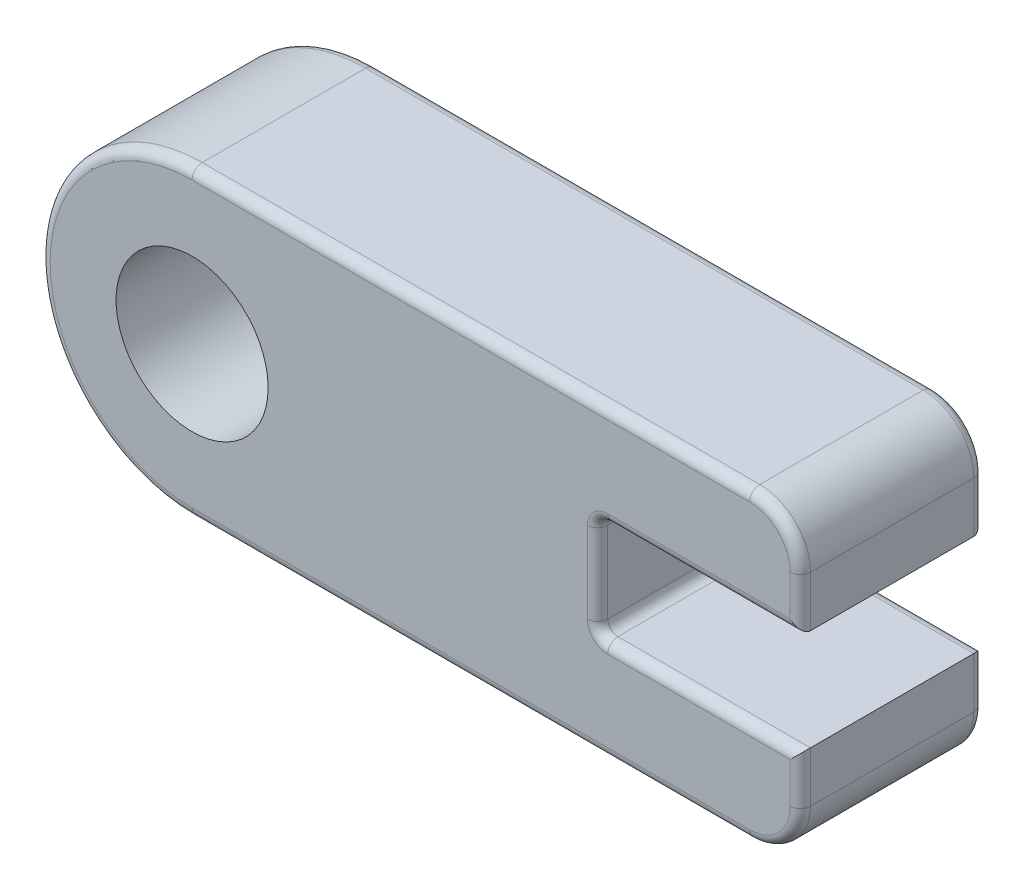
ISO-10303-21;
HEADER;
FILE_DESCRIPTION(('STEP AP214'),'2;1');
FILE_NAME('part.step','',(''),(''),'','','');
FILE_SCHEMA(('AUTOMOTIVE_DESIGN { 1 0 10303 214 1 1 1 1 }'));
ENDSEC;
DATA;
#1=APPLICATION_CONTEXT('core data for automotive mechanical design processes');
#2=APPLICATION_PROTOCOL_DEFINITION('international standard','automotive_design',2000,#1);
#3=PRODUCT_CONTEXT('',#1,'mechanical');
#4=PRODUCT('Part','Part','',(#3));
#5=PRODUCT_RELATED_PRODUCT_CATEGORY('part','',(#4));
#6=PRODUCT_DEFINITION_FORMATION('','',#4);
#7=PRODUCT_DEFINITION_CONTEXT('part definition',#1,'design');
#8=PRODUCT_DEFINITION('design','',#6,#7);
#9=PRODUCT_DEFINITION_SHAPE('','',#8);
#10=(LENGTH_UNIT() NAMED_UNIT(*) SI_UNIT(.MILLI.,.METRE.));
#11=(NAMED_UNIT(*) PLANE_ANGLE_UNIT() SI_UNIT($,.RADIAN.));
#12=(NAMED_UNIT(*) SI_UNIT($,.STERADIAN.) SOLID_ANGLE_UNIT());
#13=UNCERTAINTY_MEASURE_WITH_UNIT(LENGTH_MEASURE(1.E-05),#10,'distance_accuracy_value','');
#14=(GEOMETRIC_REPRESENTATION_CONTEXT(3) GLOBAL_UNCERTAINTY_ASSIGNED_CONTEXT((#13)) GLOBAL_UNIT_ASSIGNED_CONTEXT((#10,
#11,#12)) REPRESENTATION_CONTEXT('',''));
#15=CARTESIAN_POINT('',(0.,0.,0.));
#16=DIRECTION('',(0.,0.,1.));
#17=DIRECTION('',(1.,0.,0.));
#18=AXIS2_PLACEMENT_3D('',#15,#16,#17);
#19=CARTESIAN_POINT('',(-50.8,0.,46.0016430566934));
#20=DIRECTION('',(0.,0.,1.));
#21=DIRECTION('',(1.,0.,0.));
#22=AXIS2_PLACEMENT_3D('',#19,#20,#21);
#23=PLANE('',#22);
#24=CARTESIAN_POINT('',(-50.8,0.,46.0016430566934));
#25=DIRECTION('',(0.,0.,1.));
#26=DIRECTION('',(1.,0.,0.));
#27=AXIS2_PLACEMENT_3D('',#24,#25,#26);
#28=CIRCLE('',#27,35.56);
#29=CARTESIAN_POINT('',(-50.8,35.56,46.0016430566934));
#30=VERTEX_POINT('',#29);
#31=CARTESIAN_POINT('',(-50.8,-35.56,46.0016430566934));
#32=VERTEX_POINT('',#31);
#33=EDGE_CURVE('E359',#30,#32,#28,.T.);
#34=ORIENTED_EDGE('',*,*,#33,.T.);
#35=DIRECTION('',(1.,0.,0.));
#36=VECTOR('',#35,1.);
#37=CARTESIAN_POINT('',(88.9,-35.56,46.0016430566934));
#38=LINE('',#37,#36);
#39=CARTESIAN_POINT('',(88.9,-35.56,46.0016430566934));
#40=VERTEX_POINT('',#39);
#41=EDGE_CURVE('E361',#32,#40,#38,.T.);
#42=ORIENTED_EDGE('',*,*,#41,.T.);
#43=CARTESIAN_POINT('',(88.9,-25.4,46.0016430566934));
#44=DIRECTION('',(0.,0.,1.));
#45=DIRECTION('',(1.,0.,0.));
#46=AXIS2_PLACEMENT_3D('',#43,#44,#45);
#47=CIRCLE('',#46,10.16);
#48=CARTESIAN_POINT('',(99.06,-25.4,46.0016430566934));
#49=VERTEX_POINT('',#48);
#50=EDGE_CURVE('E353',#40,#49,#47,.T.);
#51=ORIENTED_EDGE('',*,*,#50,.T.);
#52=DIRECTION('',(0.,1.,0.));
#53=VECTOR('',#52,1.);
#54=CARTESIAN_POINT('',(99.06,-12.7,46.0016430566934));
#55=LINE('',#54,#53);
#56=CARTESIAN_POINT('',(99.06,-15.24,46.0016430566934));
#57=VERTEX_POINT('',#56);
#58=EDGE_CURVE('E349',#49,#57,#55,.T.);
#59=ORIENTED_EDGE('',*,*,#58,.T.);
#60=DIRECTION('',(-1.,0.,0.));
#61=VECTOR('',#60,1.);
#62=CARTESIAN_POINT('',(50.8,-15.24,46.0016430566934));
#63=LINE('',#62,#61);
#64=CARTESIAN_POINT('',(53.34,-15.24,46.0016430566934));
#65=VERTEX_POINT('',#64);
#66=EDGE_CURVE('E234',#57,#65,#63,.T.);
#67=ORIENTED_EDGE('',*,*,#66,.T.);
#68=CARTESIAN_POINT('',(53.34,-10.16,46.0016430566934));
#69=DIRECTION('',(0.,0.,1.));
#70=DIRECTION('',(1.,0.,0.));
#71=AXIS2_PLACEMENT_3D('',#68,#69,#70);
#72=CIRCLE('',#71,5.08);
#73=CARTESIAN_POINT('',(48.26,-10.16,46.0016430566934));
#74=VERTEX_POINT('',#73);
#75=EDGE_CURVE('E346',#74,#65,#72,.T.);
#76=ORIENTED_EDGE('',*,*,#75,.F.);
#77=DIRECTION('',(0.,1.,0.));
#78=VECTOR('',#77,1.);
#79=CARTESIAN_POINT('',(48.26,12.7,46.0016430566934));
#80=LINE('',#79,#78);
#81=CARTESIAN_POINT('',(48.26,10.16,46.0016430566934));
#82=VERTEX_POINT('',#81);
#83=EDGE_CURVE('E342',#74,#82,#80,.T.);
#84=ORIENTED_EDGE('',*,*,#83,.T.);
#85=CARTESIAN_POINT('',(53.34,10.16,46.0016430566934));
#86=DIRECTION('',(0.,0.,1.));
#87=DIRECTION('',(1.,0.,0.));
#88=AXIS2_PLACEMENT_3D('',#85,#86,#87);
#89=CIRCLE('',#88,5.08);
#90=CARTESIAN_POINT('',(53.34,15.24,46.0016430566934));
#91=VERTEX_POINT('',#90);
#92=EDGE_CURVE('E339',#91,#82,#89,.T.);
#93=ORIENTED_EDGE('',*,*,#92,.F.);
#94=DIRECTION('',(1.,0.,0.));
#95=VECTOR('',#94,1.);
#96=CARTESIAN_POINT('',(101.6,15.24,46.0016430566934));
#97=LINE('',#96,#95);
#98=CARTESIAN_POINT('',(99.06,15.24,46.0016430566934));
#99=VERTEX_POINT('',#98);
#100=EDGE_CURVE('E344',#91,#99,#97,.T.);
#101=ORIENTED_EDGE('',*,*,#100,.T.);
#102=DIRECTION('',(0.,1.,0.));
#103=VECTOR('',#102,1.);
#104=CARTESIAN_POINT('',(99.06,25.4,46.0016430566934));
#105=LINE('',#104,#103);
#106=CARTESIAN_POINT('',(99.06,25.4,46.0016430566934));
#107=VERTEX_POINT('',#106);
#108=EDGE_CURVE('E351',#99,#107,#105,.T.);
#109=ORIENTED_EDGE('',*,*,#108,.T.);
#110=CARTESIAN_POINT('',(88.9,25.4,46.0016430566934));
#111=DIRECTION('',(0.,0.,1.));
#112=DIRECTION('',(1.,0.,0.));
#113=AXIS2_PLACEMENT_3D('',#110,#111,#112);
#114=CIRCLE('',#113,10.16);
#115=CARTESIAN_POINT('',(88.9,35.56,46.0016430566934));
#116=VERTEX_POINT('',#115);
#117=EDGE_CURVE('E355',#107,#116,#114,.T.);
#118=ORIENTED_EDGE('',*,*,#117,.T.);
#119=DIRECTION('',(-1.,0.,0.));
#120=VECTOR('',#119,1.);
#121=CARTESIAN_POINT('',(-50.8,35.56,46.0016430566934));
#122=LINE('',#121,#120);
#123=EDGE_CURVE('E357',#116,#30,#122,.T.);
#124=ORIENTED_EDGE('',*,*,#123,.T.);
#125=EDGE_LOOP('',(#34,#42,#51,#59,#67,#76,#84,#93,#101,#109,#118,#124));
#126=FACE_BOUND('',#125,.T.);
#127=CARTESIAN_POINT('',(-50.8,0.,46.0016430566934));
#128=DIRECTION('',(0.,0.,1.));
#129=DIRECTION('',(1.,0.,0.));
#130=AXIS2_PLACEMENT_3D('',#127,#128,#129);
#131=CIRCLE('',#130,19.05);
#132=CARTESIAN_POINT('',(-31.75,0.,46.0016430566934));
#133=VERTEX_POINT('',#132);
#134=EDGE_CURVE('E279',#133,#133,#131,.T.);
#135=ORIENTED_EDGE('',*,*,#134,.F.);
#136=EDGE_LOOP('',(#135));
#137=FACE_BOUND('',#136,.T.);
#138=ADVANCED_FACE('F35',(#126,#137),#23,.T.);
#139=CARTESIAN_POINT('',(-50.8,0.,0.));
#140=DIRECTION('',(0.,0.,1.));
#141=DIRECTION('',(1.,0.,0.));
#142=AXIS2_PLACEMENT_3D('',#139,#140,#141);
#143=PLANE('',#142);
#144=DIRECTION('',(0.,1.,0.));
#145=VECTOR('',#144,1.);
#146=CARTESIAN_POINT('',(99.06,0.,0.));
#147=LINE('',#146,#145);
#148=CARTESIAN_POINT('',(99.06,-15.24,0.));
#149=VERTEX_POINT('',#148);
#150=CARTESIAN_POINT('',(99.06,-25.4,0.));
#151=VERTEX_POINT('',#150);
#152=EDGE_CURVE('E321',#149,#151,#147,.F.);
#153=ORIENTED_EDGE('',*,*,#152,.T.);
#154=CARTESIAN_POINT('',(88.9,-25.4,0.));
#155=DIRECTION('',(0.,0.,1.));
#156=DIRECTION('',(1.,0.,0.));
#157=AXIS2_PLACEMENT_3D('',#154,#155,#156);
#158=CIRCLE('',#157,10.16);
#159=CARTESIAN_POINT('',(88.9,-35.56,0.));
#160=VERTEX_POINT('',#159);
#161=EDGE_CURVE('E331',#151,#160,#158,.F.);
#162=ORIENTED_EDGE('',*,*,#161,.T.);
#163=DIRECTION('',(1.,0.,0.));
#164=VECTOR('',#163,1.);
#165=CARTESIAN_POINT('',(-50.8,-35.56,0.));
#166=LINE('',#165,#164);
#167=CARTESIAN_POINT('',(-50.8,-35.56,0.));
#168=VERTEX_POINT('',#167);
#169=EDGE_CURVE('E329',#160,#168,#166,.F.);
#170=ORIENTED_EDGE('',*,*,#169,.T.);
#171=CARTESIAN_POINT('',(-50.8,0.,0.));
#172=DIRECTION('',(0.,0.,1.));
#173=DIRECTION('',(1.,0.,0.));
#174=AXIS2_PLACEMENT_3D('',#171,#172,#173);
#175=CIRCLE('',#174,35.56);
#176=CARTESIAN_POINT('',(-50.8,35.56,0.));
#177=VERTEX_POINT('',#176);
#178=EDGE_CURVE('E327',#168,#177,#175,.F.);
#179=ORIENTED_EDGE('',*,*,#178,.T.);
#180=DIRECTION('',(-1.,0.,0.));
#181=VECTOR('',#180,1.);
#182=CARTESIAN_POINT('',(-50.8,35.56,0.));
#183=LINE('',#182,#181);
#184=CARTESIAN_POINT('',(88.9,35.56,0.));
#185=VERTEX_POINT('',#184);
#186=EDGE_CURVE('E325',#177,#185,#183,.F.);
#187=ORIENTED_EDGE('',*,*,#186,.T.);
#188=CARTESIAN_POINT('',(88.9,25.4,0.));
#189=DIRECTION('',(0.,0.,1.));
#190=DIRECTION('',(1.,0.,0.));
#191=AXIS2_PLACEMENT_3D('',#188,#189,#190);
#192=CIRCLE('',#191,10.16);
#193=CARTESIAN_POINT('',(99.06,25.4,0.));
#194=VERTEX_POINT('',#193);
#195=EDGE_CURVE('E323',#185,#194,#192,.F.);
#196=ORIENTED_EDGE('',*,*,#195,.T.);
#197=DIRECTION('',(0.,1.,0.));
#198=VECTOR('',#197,1.);
#199=CARTESIAN_POINT('',(99.06,0.,0.));
#200=LINE('',#199,#198);
#201=CARTESIAN_POINT('',(99.06,15.24,0.));
#202=VERTEX_POINT('',#201);
#203=EDGE_CURVE('E319',#194,#202,#200,.F.);
#204=ORIENTED_EDGE('',*,*,#203,.T.);
#205=DIRECTION('',(1.,0.,0.));
#206=VECTOR('',#205,1.);
#207=CARTESIAN_POINT('',(-50.8,15.24,0.));
#208=LINE('',#207,#206);
#209=CARTESIAN_POINT('',(53.34,15.24,0.));
#210=VERTEX_POINT('',#209);
#211=EDGE_CURVE('E314',#202,#210,#208,.F.);
#212=ORIENTED_EDGE('',*,*,#211,.T.);
#213=CARTESIAN_POINT('',(53.34,10.16,0.));
#214=DIRECTION('',(0.,0.,1.));
#215=DIRECTION('',(1.,0.,0.));
#216=AXIS2_PLACEMENT_3D('',#213,#214,#215);
#217=CIRCLE('',#216,5.08);
#218=CARTESIAN_POINT('',(48.26,10.16,0.));
#219=VERTEX_POINT('',#218);
#220=EDGE_CURVE('E311',#219,#210,#217,.F.);
#221=ORIENTED_EDGE('',*,*,#220,.F.);
#222=DIRECTION('',(0.,1.,0.));
#223=VECTOR('',#222,1.);
#224=CARTESIAN_POINT('',(48.26,0.,0.));
#225=LINE('',#224,#223);
#226=CARTESIAN_POINT('',(48.26,-10.16,0.));
#227=VERTEX_POINT('',#226);
#228=EDGE_CURVE('E309',#219,#227,#225,.F.);
#229=ORIENTED_EDGE('',*,*,#228,.T.);
#230=CARTESIAN_POINT('',(53.34,-10.16,0.));
#231=DIRECTION('',(0.,0.,1.));
#232=DIRECTION('',(1.,0.,0.));
#233=AXIS2_PLACEMENT_3D('',#230,#231,#232);
#234=CIRCLE('',#233,5.08);
#235=CARTESIAN_POINT('',(53.34,-15.24,0.));
#236=VERTEX_POINT('',#235);
#237=EDGE_CURVE('E306',#236,#227,#234,.F.);
#238=ORIENTED_EDGE('',*,*,#237,.F.);
#239=DIRECTION('',(-1.,0.,0.));
#240=VECTOR('',#239,1.);
#241=CARTESIAN_POINT('',(-50.8,-15.24,0.));
#242=LINE('',#241,#240);
#243=EDGE_CURVE('E316',#236,#149,#242,.F.);
#244=ORIENTED_EDGE('',*,*,#243,.T.);
#245=EDGE_LOOP('',(#153,#162,#170,#179,#187,#196,#204,#212,#221,#229,#238,#244));
#246=FACE_BOUND('',#245,.T.);
#247=CARTESIAN_POINT('',(-50.8,0.,0.));
#248=DIRECTION('',(0.,0.,1.));
#249=DIRECTION('',(1.,0.,0.));
#250=AXIS2_PLACEMENT_3D('',#247,#248,#249);
#251=CIRCLE('',#250,19.05);
#252=CARTESIAN_POINT('',(-31.75,0.,0.));
#253=VERTEX_POINT('',#252);
#254=EDGE_CURVE('E273',#253,#253,#251,.T.);
#255=ORIENTED_EDGE('',*,*,#254,.T.);
#256=EDGE_LOOP('',(#255));
#257=FACE_BOUND('',#256,.T.);
#258=ADVANCED_FACE('F468',(#246,#257),#143,.F.);
#259=CARTESIAN_POINT('',(-50.8,0.,46.0016430566934));
#260=DIRECTION('',(0.,0.,-1.));
#261=DIRECTION('',(-1.,0.,0.));
#262=AXIS2_PLACEMENT_3D('',#259,#260,#261);
#263=CYLINDRICAL_SURFACE('',#262,38.1);
#264=DIRECTION('',(0.,0.,-1.));
#265=VECTOR('',#264,1.);
#266=CARTESIAN_POINT('',(-50.8,-38.1,46.0016430566934));
#267=LINE('',#266,#265);
#268=CARTESIAN_POINT('',(-50.8,-38.1,43.4616430566934));
#269=VERTEX_POINT('',#268);
#270=CARTESIAN_POINT('',(-50.8,-38.1,2.54));
#271=VERTEX_POINT('',#270);
#272=EDGE_CURVE('E218',#269,#271,#267,.T.);
#273=ORIENTED_EDGE('',*,*,#272,.F.);
#274=CARTESIAN_POINT('',(-50.8,0.,43.4616430566934));
#275=DIRECTION('',(0.,0.,1.));
#276=DIRECTION('',(1.,0.,0.));
#277=AXIS2_PLACEMENT_3D('',#274,#275,#276);
#278=CIRCLE('',#277,38.1);
#279=CARTESIAN_POINT('',(-50.8,38.1,43.4616430566934));
#280=VERTEX_POINT('',#279);
#281=EDGE_CURVE('E381',#269,#280,#278,.F.);
#282=ORIENTED_EDGE('',*,*,#281,.T.);
#283=DIRECTION('',(0.,0.,-1.));
#284=VECTOR('',#283,1.);
#285=CARTESIAN_POINT('',(-50.8,38.1,46.0016430566934));
#286=LINE('',#285,#284);
#287=CARTESIAN_POINT('',(-50.8,38.1,2.54));
#288=VERTEX_POINT('',#287);
#289=EDGE_CURVE('E284',#280,#288,#286,.T.);
#290=ORIENTED_EDGE('',*,*,#289,.T.);
#291=CARTESIAN_POINT('',(-50.8,0.,2.54));
#292=DIRECTION('',(0.,0.,1.));
#293=DIRECTION('',(1.,0.,0.));
#294=AXIS2_PLACEMENT_3D('',#291,#292,#293);
#295=CIRCLE('',#294,38.1);
#296=EDGE_CURVE('E379',#288,#271,#295,.T.);
#297=ORIENTED_EDGE('',*,*,#296,.T.);
#298=EDGE_LOOP('',(#273,#282,#290,#297));
#299=FACE_BOUND('',#298,.T.);
#300=ADVANCED_FACE('F474',(#299),#263,.T.);
#301=CARTESIAN_POINT('',(101.6,-38.1,46.0016430566934));
#302=DIRECTION('',(0.,1.,0.));
#303=DIRECTION('',(-1.,0.,0.));
#304=AXIS2_PLACEMENT_3D('',#301,#302,#303);
#305=PLANE('',#304);
#306=DIRECTION('',(0.,0.,-1.));
#307=VECTOR('',#306,1.);
#308=CARTESIAN_POINT('',(88.9,-38.1,46.0016430566934));
#309=LINE('',#308,#307);
#310=CARTESIAN_POINT('',(88.9,-38.1,2.54));
#311=VERTEX_POINT('',#310);
#312=CARTESIAN_POINT('',(88.9,-38.1,43.4616430566934));
#313=VERTEX_POINT('',#312);
#314=EDGE_CURVE('E295',#311,#313,#309,.F.);
#315=ORIENTED_EDGE('',*,*,#314,.T.);
#316=DIRECTION('',(1.,0.,0.));
#317=VECTOR('',#316,1.);
#318=CARTESIAN_POINT('',(-50.8,-38.1,43.4616430566934));
#319=LINE('',#318,#317);
#320=EDGE_CURVE('E377',#313,#269,#319,.F.);
#321=ORIENTED_EDGE('',*,*,#320,.T.);
#322=ORIENTED_EDGE('',*,*,#272,.T.);
#323=DIRECTION('',(1.,0.,0.));
#324=VECTOR('',#323,1.);
#325=CARTESIAN_POINT('',(101.6,-38.1,2.54));
#326=LINE('',#325,#324);
#327=EDGE_CURVE('E375',#271,#311,#326,.T.);
#328=ORIENTED_EDGE('',*,*,#327,.T.);
#329=EDGE_LOOP('',(#315,#321,#322,#328));
#330=FACE_BOUND('',#329,.T.);
#331=ADVANCED_FACE('F541',(#330),#305,.F.);
#332=CARTESIAN_POINT('',(101.6,-12.7,46.0016430566934));
#333=DIRECTION('',(-1.,0.,0.));
#334=DIRECTION('',(0.,-1.,0.));
#335=AXIS2_PLACEMENT_3D('',#332,#333,#334);
#336=PLANE('',#335);
#337=DIRECTION('',(0.,0.,-1.));
#338=VECTOR('',#337,1.);
#339=CARTESIAN_POINT('',(101.6,-12.7,46.0016430566934));
#340=LINE('',#339,#338);
#341=CARTESIAN_POINT('',(101.6,-12.7,43.4616430566934));
#342=VERTEX_POINT('',#341);
#343=CARTESIAN_POINT('',(101.6,-12.7,2.54));
#344=VERTEX_POINT('',#343);
#345=EDGE_CURVE('E200',#342,#344,#340,.T.);
#346=ORIENTED_EDGE('',*,*,#345,.F.);
#347=DIRECTION('',(0.,1.,0.));
#348=VECTOR('',#347,1.);
#349=CARTESIAN_POINT('',(101.6,-25.4,43.4616430566934));
#350=LINE('',#349,#348);
#351=CARTESIAN_POINT('',(101.6,-25.4,43.4616430566934));
#352=VERTEX_POINT('',#351);
#353=EDGE_CURVE('E214',#342,#352,#350,.F.);
#354=ORIENTED_EDGE('',*,*,#353,.T.);
#355=DIRECTION('',(0.,0.,-1.));
#356=VECTOR('',#355,1.);
#357=CARTESIAN_POINT('',(101.6,-25.4,46.0016430566934));
#358=LINE('',#357,#356);
#359=CARTESIAN_POINT('',(101.6,-25.4,2.54));
#360=VERTEX_POINT('',#359);
#361=EDGE_CURVE('E293',#352,#360,#358,.T.);
#362=ORIENTED_EDGE('',*,*,#361,.T.);
#363=DIRECTION('',(0.,1.,0.));
#364=VECTOR('',#363,1.);
#365=CARTESIAN_POINT('',(101.6,-12.7,2.54));
#366=LINE('',#365,#364);
#367=EDGE_CURVE('E217',#360,#344,#366,.T.);
#368=ORIENTED_EDGE('',*,*,#367,.T.);
#369=EDGE_LOOP('',(#346,#354,#362,#368));
#370=FACE_BOUND('',#369,.T.);
#371=ADVANCED_FACE('F212',(#370),#336,.F.);
#372=CARTESIAN_POINT('',(50.8,-12.7,46.0016430566934));
#373=DIRECTION('',(0.,-1.,0.));
#374=DIRECTION('',(0.,0.,-1.));
#375=AXIS2_PLACEMENT_3D('',#372,#373,#374);
#376=PLANE('',#375);
#377=ORIENTED_EDGE('',*,*,#345,.T.);
#378=DIRECTION('',(-1.,0.,0.));
#379=VECTOR('',#378,1.);
#380=CARTESIAN_POINT('',(50.8,-12.7,2.54));
#381=LINE('',#380,#379);
#382=CARTESIAN_POINT('',(53.34,-12.7,2.54));
#383=VERTEX_POINT('',#382);
#384=EDGE_CURVE('E208',#344,#383,#381,.T.);
#385=ORIENTED_EDGE('',*,*,#384,.T.);
#386=DIRECTION('',(0.,0.,-1.));
#387=VECTOR('',#386,1.);
#388=CARTESIAN_POINT('',(53.34,-12.7,46.0016430566934));
#389=LINE('',#388,#387);
#390=CARTESIAN_POINT('',(53.34,-12.7,43.4616430566934));
#391=VERTEX_POINT('',#390);
#392=EDGE_CURVE('E203',#383,#391,#389,.F.);
#393=ORIENTED_EDGE('',*,*,#392,.T.);
#394=DIRECTION('',(-1.,0.,0.));
#395=VECTOR('',#394,1.);
#396=CARTESIAN_POINT('',(101.6,-12.7,43.4616430566934));
#397=LINE('',#396,#395);
#398=EDGE_CURVE('E196',#391,#342,#397,.F.);
#399=ORIENTED_EDGE('',*,*,#398,.T.);
#400=EDGE_LOOP('',(#377,#385,#393,#399));
#401=FACE_BOUND('',#400,.T.);
#402=ADVANCED_FACE('F198',(#401),#376,.F.);
#403=CARTESIAN_POINT('',(50.8,12.7,46.0016430566934));
#404=DIRECTION('',(-1.,0.,0.));
#405=DIRECTION('',(0.,-1.,0.));
#406=AXIS2_PLACEMENT_3D('',#403,#404,#405);
#407=PLANE('',#406);
#408=DIRECTION('',(0.,1.,0.));
#409=VECTOR('',#408,1.);
#410=CARTESIAN_POINT('',(50.8,-12.7,43.4616430566934));
#411=LINE('',#410,#409);
#412=CARTESIAN_POINT('',(50.8,10.16,43.4616430566934));
#413=VERTEX_POINT('',#412);
#414=CARTESIAN_POINT('',(50.8,-10.16,43.4616430566934));
#415=VERTEX_POINT('',#414);
#416=EDGE_CURVE('E55',#413,#415,#411,.F.);
#417=ORIENTED_EDGE('',*,*,#416,.T.);
#418=DIRECTION('',(0.,0.,-1.));
#419=VECTOR('',#418,1.);
#420=CARTESIAN_POINT('',(50.8,-10.16,0.));
#421=LINE('',#420,#419);
#422=CARTESIAN_POINT('',(50.8,-10.16,2.54));
#423=VERTEX_POINT('',#422);
#424=EDGE_CURVE('E11',#415,#423,#421,.T.);
#425=ORIENTED_EDGE('',*,*,#424,.T.);
#426=DIRECTION('',(0.,1.,0.));
#427=VECTOR('',#426,1.);
#428=CARTESIAN_POINT('',(50.8,12.7,2.54));
#429=LINE('',#428,#427);
#430=CARTESIAN_POINT('',(50.8,10.16,2.54));
#431=VERTEX_POINT('',#430);
#432=EDGE_CURVE('E44',#423,#431,#429,.T.);
#433=ORIENTED_EDGE('',*,*,#432,.T.);
#434=DIRECTION('',(0.,0.,-1.));
#435=VECTOR('',#434,1.);
#436=CARTESIAN_POINT('',(50.8,10.16,46.0016430566934));
#437=LINE('',#436,#435);
#438=EDGE_CURVE('E387',#431,#413,#437,.F.);
#439=ORIENTED_EDGE('',*,*,#438,.T.);
#440=EDGE_LOOP('',(#417,#425,#433,#439));
#441=FACE_BOUND('',#440,.T.);
#442=ADVANCED_FACE('F455',(#441),#407,.F.);
#443=CARTESIAN_POINT('',(101.6,12.7,46.0016430566934));
#444=DIRECTION('',(0.,1.,0.));
#445=DIRECTION('',(-1.,0.,0.));
#446=AXIS2_PLACEMENT_3D('',#443,#444,#445);
#447=PLANE('',#446);
#448=DIRECTION('',(0.,0.,-1.));
#449=VECTOR('',#448,1.);
#450=CARTESIAN_POINT('',(53.34,12.7,0.));
#451=LINE('',#450,#449);
#452=CARTESIAN_POINT('',(53.34,12.7,43.4616430566934));
#453=VERTEX_POINT('',#452);
#454=CARTESIAN_POINT('',(53.34,12.7,2.54));
#455=VERTEX_POINT('',#454);
#456=EDGE_CURVE('E333',#453,#455,#451,.T.);
#457=ORIENTED_EDGE('',*,*,#456,.T.);
#458=DIRECTION('',(1.,0.,0.));
#459=VECTOR('',#458,1.);
#460=CARTESIAN_POINT('',(101.6,12.7,2.54));
#461=LINE('',#460,#459);
#462=CARTESIAN_POINT('',(101.6,12.7,2.54));
#463=VERTEX_POINT('',#462);
#464=EDGE_CURVE('E337',#455,#463,#461,.T.);
#465=ORIENTED_EDGE('',*,*,#464,.T.);
#466=DIRECTION('',(0.,0.,-1.));
#467=VECTOR('',#466,1.);
#468=CARTESIAN_POINT('',(101.6,12.7,46.0016430566934));
#469=LINE('',#468,#467);
#470=CARTESIAN_POINT('',(101.6,12.7,43.4616430566934));
#471=VERTEX_POINT('',#470);
#472=EDGE_CURVE('E219',#471,#463,#469,.T.);
#473=ORIENTED_EDGE('',*,*,#472,.F.);
#474=DIRECTION('',(1.,0.,0.));
#475=VECTOR('',#474,1.);
#476=CARTESIAN_POINT('',(50.8,12.7,43.4616430566934));
#477=LINE('',#476,#475);
#478=EDGE_CURVE('E335',#471,#453,#477,.F.);
#479=ORIENTED_EDGE('',*,*,#478,.T.);
#480=EDGE_LOOP('',(#457,#465,#473,#479));
#481=FACE_BOUND('',#480,.T.);
#482=ADVANCED_FACE('F457',(#481),#447,.F.);
#483=CARTESIAN_POINT('',(101.6,38.1,46.0016430566934));
#484=DIRECTION('',(-1.,0.,0.));
#485=DIRECTION('',(0.,0.,1.));
#486=AXIS2_PLACEMENT_3D('',#483,#484,#485);
#487=PLANE('',#486);
#488=DIRECTION('',(0.,0.,-1.));
#489=VECTOR('',#488,1.);
#490=CARTESIAN_POINT('',(101.6,25.4,46.0016430566934));
#491=LINE('',#490,#489);
#492=CARTESIAN_POINT('',(101.6,25.4,2.54));
#493=VERTEX_POINT('',#492);
#494=CARTESIAN_POINT('',(101.6,25.4,43.4616430566934));
#495=VERTEX_POINT('',#494);
#496=EDGE_CURVE('E301',#493,#495,#491,.F.);
#497=ORIENTED_EDGE('',*,*,#496,.T.);
#498=DIRECTION('',(0.,1.,0.));
#499=VECTOR('',#498,1.);
#500=CARTESIAN_POINT('',(101.6,12.7,43.4616430566934));
#501=LINE('',#500,#499);
#502=EDGE_CURVE('E365',#495,#471,#501,.F.);
#503=ORIENTED_EDGE('',*,*,#502,.T.);
#504=ORIENTED_EDGE('',*,*,#472,.T.);
#505=DIRECTION('',(0.,1.,0.));
#506=VECTOR('',#505,1.);
#507=CARTESIAN_POINT('',(101.6,38.1,2.54));
#508=LINE('',#507,#506);
#509=EDGE_CURVE('E363',#463,#493,#508,.T.);
#510=ORIENTED_EDGE('',*,*,#509,.T.);
#511=EDGE_LOOP('',(#497,#503,#504,#510));
#512=FACE_BOUND('',#511,.T.);
#513=ADVANCED_FACE('F463',(#512),#487,.F.);
#514=CARTESIAN_POINT('',(-50.8,38.1,46.0016430566934));
#515=DIRECTION('',(0.,-1.,0.));
#516=DIRECTION('',(1.,0.,0.));
#517=AXIS2_PLACEMENT_3D('',#514,#515,#516);
#518=PLANE('',#517);
#519=DIRECTION('',(0.,0.,-1.));
#520=VECTOR('',#519,1.);
#521=CARTESIAN_POINT('',(88.9,38.1,46.0016430566934));
#522=LINE('',#521,#520);
#523=CARTESIAN_POINT('',(88.9,38.1,43.4616430566934));
#524=VERTEX_POINT('',#523);
#525=CARTESIAN_POINT('',(88.9,38.1,2.54));
#526=VERTEX_POINT('',#525);
#527=EDGE_CURVE('E298',#524,#526,#522,.T.);
#528=ORIENTED_EDGE('',*,*,#527,.T.);
#529=DIRECTION('',(-1.,0.,0.));
#530=VECTOR('',#529,1.);
#531=CARTESIAN_POINT('',(-50.8,38.1,2.54));
#532=LINE('',#531,#530);
#533=EDGE_CURVE('E385',#526,#288,#532,.T.);
#534=ORIENTED_EDGE('',*,*,#533,.T.);
#535=ORIENTED_EDGE('',*,*,#289,.F.);
#536=DIRECTION('',(-1.,0.,0.));
#537=VECTOR('',#536,1.);
#538=CARTESIAN_POINT('',(88.8999999999999,38.1,43.4616430566934));
#539=LINE('',#538,#537);
#540=EDGE_CURVE('E383',#280,#524,#539,.F.);
#541=ORIENTED_EDGE('',*,*,#540,.T.);
#542=EDGE_LOOP('',(#528,#534,#535,#541));
#543=FACE_BOUND('',#542,.T.);
#544=ADVANCED_FACE('F481',(#543),#518,.F.);
#545=CARTESIAN_POINT('',(-50.8,0.,46.0016430566934));
#546=DIRECTION('',(0.,0.,-1.));
#547=DIRECTION('',(-1.,0.,0.));
#548=AXIS2_PLACEMENT_3D('',#545,#546,#547);
#549=CYLINDRICAL_SURFACE('',#548,19.05);
#550=ORIENTED_EDGE('',*,*,#134,.T.);
#551=EDGE_LOOP('',(#550));
#552=FACE_BOUND('',#551,.T.);
#553=ORIENTED_EDGE('',*,*,#254,.F.);
#554=EDGE_LOOP('',(#553));
#555=FACE_BOUND('',#554,.T.);
#556=ADVANCED_FACE('F479',(#552,#555),#549,.F.);
#557=CARTESIAN_POINT('',(88.9,-25.4,46.0016430566934));
#558=DIRECTION('',(0.,0.,-1.));
#559=DIRECTION('',(-1.,0.,0.));
#560=AXIS2_PLACEMENT_3D('',#557,#558,#559);
#561=CYLINDRICAL_SURFACE('',#560,12.7);
#562=ORIENTED_EDGE('',*,*,#361,.F.);
#563=CARTESIAN_POINT('',(88.9,-25.4,43.4616430566934));
#564=DIRECTION('',(0.,0.,1.));
#565=DIRECTION('',(1.,0.,0.));
#566=AXIS2_PLACEMENT_3D('',#563,#564,#565);
#567=CIRCLE('',#566,12.7);
#568=EDGE_CURVE('E373',#352,#313,#567,.F.);
#569=ORIENTED_EDGE('',*,*,#568,.T.);
#570=ORIENTED_EDGE('',*,*,#314,.F.);
#571=CARTESIAN_POINT('',(88.9,-25.4,2.54));
#572=DIRECTION('',(0.,0.,1.));
#573=DIRECTION('',(1.,0.,0.));
#574=AXIS2_PLACEMENT_3D('',#571,#572,#573);
#575=CIRCLE('',#574,12.7);
#576=EDGE_CURVE('E230',#311,#360,#575,.T.);
#577=ORIENTED_EDGE('',*,*,#576,.T.);
#578=EDGE_LOOP('',(#562,#569,#570,#577));
#579=FACE_BOUND('',#578,.T.);
#580=ADVANCED_FACE('F537',(#579),#561,.T.);
#581=CARTESIAN_POINT('',(88.9,25.4,46.0016430566934));
#582=DIRECTION('',(0.,0.,-1.));
#583=DIRECTION('',(-1.,0.,0.));
#584=AXIS2_PLACEMENT_3D('',#581,#582,#583);
#585=CYLINDRICAL_SURFACE('',#584,12.7);
#586=ORIENTED_EDGE('',*,*,#527,.F.);
#587=CARTESIAN_POINT('',(88.9,25.4,43.4616430566934));
#588=DIRECTION('',(0.,0.,1.));
#589=DIRECTION('',(1.,0.,0.));
#590=AXIS2_PLACEMENT_3D('',#587,#588,#589);
#591=CIRCLE('',#590,12.7);
#592=EDGE_CURVE('E369',#524,#495,#591,.F.);
#593=ORIENTED_EDGE('',*,*,#592,.T.);
#594=ORIENTED_EDGE('',*,*,#496,.F.);
#595=CARTESIAN_POINT('',(88.9,25.4,2.54));
#596=DIRECTION('',(0.,0.,1.));
#597=DIRECTION('',(1.,0.,0.));
#598=AXIS2_PLACEMENT_3D('',#595,#596,#597);
#599=CIRCLE('',#598,12.7);
#600=EDGE_CURVE('E367',#493,#526,#599,.T.);
#601=ORIENTED_EDGE('',*,*,#600,.T.);
#602=EDGE_LOOP('',(#586,#593,#594,#601));
#603=FACE_BOUND('',#602,.T.);
#604=ADVANCED_FACE('F523',(#603),#585,.T.);
#605=CARTESIAN_POINT('',(-50.8,35.56,43.4616430566934));
#606=DIRECTION('',(1.,0.,0.));
#607=DIRECTION('',(0.,1.,0.));
#608=AXIS2_PLACEMENT_3D('',#605,#606,#607);
#609=CYLINDRICAL_SURFACE('',#608,2.54);
#610=CARTESIAN_POINT('',(88.9,35.56,43.4616430566934));
#611=DIRECTION('',(1.,0.,0.));
#612=DIRECTION('',(0.,0.,-1.));
#613=AXIS2_PLACEMENT_3D('',#610,#611,#612);
#614=CIRCLE('',#613,2.54);
#615=EDGE_CURVE('E266',#524,#116,#614,.T.);
#616=ORIENTED_EDGE('',*,*,#615,.F.);
#617=ORIENTED_EDGE('',*,*,#540,.F.);
#618=CARTESIAN_POINT('',(-50.8,35.56,43.4616430566934));
#619=DIRECTION('',(-1.,0.,0.));
#620=DIRECTION('',(0.,0.,1.));
#621=AXIS2_PLACEMENT_3D('',#618,#619,#620);
#622=CIRCLE('',#621,2.54);
#623=EDGE_CURVE('E39',#30,#280,#622,.T.);
#624=ORIENTED_EDGE('',*,*,#623,.F.);
#625=ORIENTED_EDGE('',*,*,#123,.F.);
#626=EDGE_LOOP('',(#616,#617,#624,#625));
#627=FACE_BOUND('',#626,.T.);
#628=ADVANCED_FACE('F37',(#627),#609,.T.);
#629=CARTESIAN_POINT('',(-50.8,0.,43.4616430566934));
#630=DIRECTION('',(0.,0.,1.));
#631=DIRECTION('',(1.,0.,0.));
#632=AXIS2_PLACEMENT_3D('',#629,#630,#631);
#633=TOROIDAL_SURFACE('',#632,35.56,2.54);
#634=ORIENTED_EDGE('',*,*,#623,.T.);
#635=ORIENTED_EDGE('',*,*,#281,.F.);
#636=CARTESIAN_POINT('',(-50.8,-35.56,43.4616430566934));
#637=DIRECTION('',(1.,0.,0.));
#638=DIRECTION('',(0.,0.,-1.));
#639=AXIS2_PLACEMENT_3D('',#636,#637,#638);
#640=CIRCLE('',#639,2.54);
#641=EDGE_CURVE('E264',#32,#269,#640,.T.);
#642=ORIENTED_EDGE('',*,*,#641,.F.);
#643=ORIENTED_EDGE('',*,*,#33,.F.);
#644=EDGE_LOOP('',(#634,#635,#642,#643));
#645=FACE_BOUND('',#644,.T.);
#646=ADVANCED_FACE('F546',(#645),#633,.T.);
#647=CARTESIAN_POINT('',(88.9,25.4,43.4616430566934));
#648=DIRECTION('',(0.,0.,1.));
#649=DIRECTION('',(1.,0.,0.));
#650=AXIS2_PLACEMENT_3D('',#647,#648,#649);
#651=TOROIDAL_SURFACE('',#650,10.16,2.54);
#652=ORIENTED_EDGE('',*,*,#615,.T.);
#653=ORIENTED_EDGE('',*,*,#117,.F.);
#654=CARTESIAN_POINT('',(99.06,25.4,43.4616430566934));
#655=DIRECTION('',(0.,-1.,0.));
#656=DIRECTION('',(0.,0.,-1.));
#657=AXIS2_PLACEMENT_3D('',#654,#655,#656);
#658=CIRCLE('',#657,2.54);
#659=EDGE_CURVE('E261',#495,#107,#658,.T.);
#660=ORIENTED_EDGE('',*,*,#659,.F.);
#661=ORIENTED_EDGE('',*,*,#592,.F.);
#662=EDGE_LOOP('',(#652,#653,#660,#661));
#663=FACE_BOUND('',#662,.T.);
#664=ADVANCED_FACE('F496',(#663),#651,.T.);
#665=CARTESIAN_POINT('',(-50.8,-35.56,43.4616430566934));
#666=DIRECTION('',(-1.,0.,0.));
#667=DIRECTION('',(0.,-1.,0.));
#668=AXIS2_PLACEMENT_3D('',#665,#666,#667);
#669=CYLINDRICAL_SURFACE('',#668,2.54);
#670=ORIENTED_EDGE('',*,*,#641,.T.);
#671=ORIENTED_EDGE('',*,*,#320,.F.);
#672=CARTESIAN_POINT('',(88.9,-35.56,43.4616430566934));
#673=DIRECTION('',(1.,0.,0.));
#674=DIRECTION('',(0.,0.,-1.));
#675=AXIS2_PLACEMENT_3D('',#672,#673,#674);
#676=CIRCLE('',#675,2.54);
#677=EDGE_CURVE('E258',#40,#313,#676,.T.);
#678=ORIENTED_EDGE('',*,*,#677,.F.);
#679=ORIENTED_EDGE('',*,*,#41,.F.);
#680=EDGE_LOOP('',(#670,#671,#678,#679));
#681=FACE_BOUND('',#680,.T.);
#682=ADVANCED_FACE('F545',(#681),#669,.T.);
#683=CARTESIAN_POINT('',(99.06,0.,43.4616430566934));
#684=DIRECTION('',(0.,-1.,0.));
#685=DIRECTION('',(0.,0.,-1.));
#686=AXIS2_PLACEMENT_3D('',#683,#684,#685);
#687=CYLINDRICAL_SURFACE('',#686,2.54);
#688=ORIENTED_EDGE('',*,*,#659,.T.);
#689=ORIENTED_EDGE('',*,*,#108,.F.);
#690=CARTESIAN_POINT('',(99.06,15.24,43.4616430566934));
#691=DIRECTION('',(-0.707106781186547,-0.707106781186548,0.));
#692=DIRECTION('',(0.707106781186548,-0.707106781186547,0.));
#693=AXIS2_PLACEMENT_3D('',#690,#691,#692);
#694=ELLIPSE('',#693,3.59210244842766,2.54);
#695=EDGE_CURVE('E255',#471,#99,#694,.T.);
#696=ORIENTED_EDGE('',*,*,#695,.F.);
#697=ORIENTED_EDGE('',*,*,#502,.F.);
#698=EDGE_LOOP('',(#688,#689,#696,#697));
#699=FACE_BOUND('',#698,.T.);
#700=ADVANCED_FACE('F500',(#699),#687,.T.);
#701=CARTESIAN_POINT('',(88.9,-25.4,43.4616430566934));
#702=DIRECTION('',(0.,0.,1.));
#703=DIRECTION('',(1.,0.,0.));
#704=AXIS2_PLACEMENT_3D('',#701,#702,#703);
#705=TOROIDAL_SURFACE('',#704,10.16,2.54);
#706=ORIENTED_EDGE('',*,*,#677,.T.);
#707=ORIENTED_EDGE('',*,*,#568,.F.);
#708=CARTESIAN_POINT('',(99.06,-25.4,43.4616430566934));
#709=DIRECTION('',(0.,1.,0.));
#710=DIRECTION('',(0.,0.,1.));
#711=AXIS2_PLACEMENT_3D('',#708,#709,#710);
#712=CIRCLE('',#711,2.54);
#713=EDGE_CURVE('E229',#49,#352,#712,.T.);
#714=ORIENTED_EDGE('',*,*,#713,.F.);
#715=ORIENTED_EDGE('',*,*,#50,.F.);
#716=EDGE_LOOP('',(#706,#707,#714,#715));
#717=FACE_BOUND('',#716,.T.);
#718=ADVANCED_FACE('F534',(#717),#705,.T.);
#719=CARTESIAN_POINT('',(-50.8,15.24,43.4616430566934));
#720=DIRECTION('',(-1.,0.,0.));
#721=DIRECTION('',(0.,-1.,0.));
#722=AXIS2_PLACEMENT_3D('',#719,#720,#721);
#723=CYLINDRICAL_SURFACE('',#722,2.54);
#724=ORIENTED_EDGE('',*,*,#695,.T.);
#725=ORIENTED_EDGE('',*,*,#100,.F.);
#726=CARTESIAN_POINT('',(53.34,15.24,43.4616430566934));
#727=DIRECTION('',(-1.,0.,0.));
#728=DIRECTION('',(0.,0.,1.));
#729=AXIS2_PLACEMENT_3D('',#726,#727,#728);
#730=CIRCLE('',#729,2.54);
#731=EDGE_CURVE('E248',#453,#91,#730,.T.);
#732=ORIENTED_EDGE('',*,*,#731,.F.);
#733=ORIENTED_EDGE('',*,*,#478,.F.);
#734=EDGE_LOOP('',(#724,#725,#732,#733));
#735=FACE_BOUND('',#734,.T.);
#736=ADVANCED_FACE('F505',(#735),#723,.T.);
#737=CARTESIAN_POINT('',(88.9,25.4,2.54));
#738=DIRECTION('',(0.,0.,1.));
#739=DIRECTION('',(1.,0.,0.));
#740=AXIS2_PLACEMENT_3D('',#737,#738,#739);
#741=TOROIDAL_SURFACE('',#740,10.16,2.54);
#742=CARTESIAN_POINT('',(99.06,25.4,2.54));
#743=DIRECTION('',(0.,-1.,0.));
#744=DIRECTION('',(0.,0.,-1.));
#745=AXIS2_PLACEMENT_3D('',#742,#743,#744);
#746=CIRCLE('',#745,2.54);
#747=EDGE_CURVE('E239',#194,#493,#746,.T.);
#748=ORIENTED_EDGE('',*,*,#747,.F.);
#749=ORIENTED_EDGE('',*,*,#195,.F.);
#750=CARTESIAN_POINT('',(88.9,35.56,2.54));
#751=DIRECTION('',(-1.,0.,0.));
#752=DIRECTION('',(0.,0.,1.));
#753=AXIS2_PLACEMENT_3D('',#750,#751,#752);
#754=CIRCLE('',#753,2.54);
#755=EDGE_CURVE('E252',#526,#185,#754,.T.);
#756=ORIENTED_EDGE('',*,*,#755,.F.);
#757=ORIENTED_EDGE('',*,*,#600,.F.);
#758=EDGE_LOOP('',(#748,#749,#756,#757));
#759=FACE_BOUND('',#758,.T.);
#760=ADVANCED_FACE('F520',(#759),#741,.T.);
#761=CARTESIAN_POINT('',(-50.8,35.56,2.54));
#762=DIRECTION('',(-1.,0.,0.));
#763=DIRECTION('',(0.,-1.,0.));
#764=AXIS2_PLACEMENT_3D('',#761,#762,#763);
#765=CYLINDRICAL_SURFACE('',#764,2.54);
#766=ORIENTED_EDGE('',*,*,#755,.T.);
#767=ORIENTED_EDGE('',*,*,#186,.F.);
#768=CARTESIAN_POINT('',(-50.8,35.56,2.54));
#769=DIRECTION('',(-1.,0.,0.));
#770=DIRECTION('',(0.,0.,1.));
#771=AXIS2_PLACEMENT_3D('',#768,#769,#770);
#772=CIRCLE('',#771,2.54);
#773=EDGE_CURVE('E235',#288,#177,#772,.T.);
#774=ORIENTED_EDGE('',*,*,#773,.F.);
#775=ORIENTED_EDGE('',*,*,#533,.F.);
#776=EDGE_LOOP('',(#766,#767,#774,#775));
#777=FACE_BOUND('',#776,.T.);
#778=ADVANCED_FACE('F570',(#777),#765,.T.);
#779=CARTESIAN_POINT('',(99.06,0.,43.4616430566934));
#780=DIRECTION('',(0.,-1.,0.));
#781=DIRECTION('',(1.,0.,0.));
#782=AXIS2_PLACEMENT_3D('',#779,#780,#781);
#783=CYLINDRICAL_SURFACE('',#782,2.54);
#784=ORIENTED_EDGE('',*,*,#713,.T.);
#785=ORIENTED_EDGE('',*,*,#353,.F.);
#786=CARTESIAN_POINT('',(99.06,-15.24,43.4616430566934));
#787=DIRECTION('',(0.707106781186548,-0.707106781186547,0.));
#788=DIRECTION('',(-0.707106781186547,-0.707106781186548,0.));
#789=AXIS2_PLACEMENT_3D('',#786,#787,#788);
#790=ELLIPSE('',#789,3.59210244842766,2.54);
#791=EDGE_CURVE('E226',#57,#342,#790,.F.);
#792=ORIENTED_EDGE('',*,*,#791,.F.);
#793=ORIENTED_EDGE('',*,*,#58,.F.);
#794=EDGE_LOOP('',(#784,#785,#792,#793));
#795=FACE_BOUND('',#794,.T.);
#796=ADVANCED_FACE('F224',(#795),#783,.T.);
#797=CARTESIAN_POINT('',(53.34,10.16,43.4616430566934));
#798=DIRECTION('',(0.,0.,1.));
#799=DIRECTION('',(1.,0.,0.));
#800=AXIS2_PLACEMENT_3D('',#797,#798,#799);
#801=TOROIDAL_SURFACE('',#800,5.08,2.54);
#802=ORIENTED_EDGE('',*,*,#731,.T.);
#803=ORIENTED_EDGE('',*,*,#92,.T.);
#804=CARTESIAN_POINT('',(48.26,10.16,43.4616430566934));
#805=DIRECTION('',(0.,1.,0.));
#806=DIRECTION('',(0.,0.,1.));
#807=AXIS2_PLACEMENT_3D('',#804,#805,#806);
#808=CIRCLE('',#807,2.54);
#809=EDGE_CURVE('E236',#413,#82,#808,.F.);
#810=ORIENTED_EDGE('',*,*,#809,.F.);
#811=CARTESIAN_POINT('',(53.34,10.16,43.4616430566934));
#812=DIRECTION('',(0.,0.,1.));
#813=DIRECTION('',(1.,0.,0.));
#814=AXIS2_PLACEMENT_3D('',#811,#812,#813);
#815=CIRCLE('',#814,2.54);
#816=EDGE_CURVE('E242',#453,#413,#815,.T.);
#817=ORIENTED_EDGE('',*,*,#816,.F.);
#818=EDGE_LOOP('',(#802,#803,#810,#817));
#819=FACE_BOUND('',#818,.T.);
#820=ADVANCED_FACE('F437',(#819),#801,.T.);
#821=CARTESIAN_POINT('',(99.06,38.1,2.54));
#822=DIRECTION('',(0.,1.,0.));
#823=DIRECTION('',(0.,0.,1.));
#824=AXIS2_PLACEMENT_3D('',#821,#822,#823);
#825=CYLINDRICAL_SURFACE('',#824,2.54);
#826=ORIENTED_EDGE('',*,*,#747,.T.);
#827=ORIENTED_EDGE('',*,*,#509,.F.);
#828=CARTESIAN_POINT('',(99.06,15.24,2.54));
#829=DIRECTION('',(0.707106781186547,0.707106781186548,0.));
#830=DIRECTION('',(-0.707106781186548,0.707106781186547,0.));
#831=AXIS2_PLACEMENT_3D('',#828,#829,#830);
#832=ELLIPSE('',#831,3.59210244842766,2.54);
#833=EDGE_CURVE('E426',#202,#463,#832,.F.);
#834=ORIENTED_EDGE('',*,*,#833,.F.);
#835=ORIENTED_EDGE('',*,*,#203,.F.);
#836=EDGE_LOOP('',(#826,#827,#834,#835));
#837=FACE_BOUND('',#836,.T.);
#838=ADVANCED_FACE('F509',(#837),#825,.T.);
#839=CARTESIAN_POINT('',(-50.8,0.,2.54));
#840=DIRECTION('',(0.,0.,1.));
#841=DIRECTION('',(1.,0.,0.));
#842=AXIS2_PLACEMENT_3D('',#839,#840,#841);
#843=TOROIDAL_SURFACE('',#842,35.56,2.54);
#844=ORIENTED_EDGE('',*,*,#773,.T.);
#845=ORIENTED_EDGE('',*,*,#178,.F.);
#846=CARTESIAN_POINT('',(-50.8,-35.56,2.54));
#847=DIRECTION('',(1.,0.,0.));
#848=DIRECTION('',(0.,0.,-1.));
#849=AXIS2_PLACEMENT_3D('',#846,#847,#848);
#850=CIRCLE('',#849,2.54);
#851=EDGE_CURVE('E423',#271,#168,#850,.T.);
#852=ORIENTED_EDGE('',*,*,#851,.F.);
#853=ORIENTED_EDGE('',*,*,#296,.F.);
#854=EDGE_LOOP('',(#844,#845,#852,#853));
#855=FACE_BOUND('',#854,.T.);
#856=ADVANCED_FACE('F553',(#855),#843,.T.);
#857=CARTESIAN_POINT('',(-50.8,-15.24,43.4616430566934));
#858=DIRECTION('',(1.,0.,0.));
#859=DIRECTION('',(0.,0.,-1.));
#860=AXIS2_PLACEMENT_3D('',#857,#858,#859);
#861=CYLINDRICAL_SURFACE('',#860,2.54);
#862=ORIENTED_EDGE('',*,*,#791,.T.);
#863=ORIENTED_EDGE('',*,*,#398,.F.);
#864=CARTESIAN_POINT('',(53.34,-15.24,43.4616430566934));
#865=DIRECTION('',(-1.,0.,0.));
#866=DIRECTION('',(0.,0.,1.));
#867=AXIS2_PLACEMENT_3D('',#864,#865,#866);
#868=CIRCLE('',#867,2.54);
#869=EDGE_CURVE('E421',#65,#391,#868,.T.);
#870=ORIENTED_EDGE('',*,*,#869,.F.);
#871=ORIENTED_EDGE('',*,*,#66,.F.);
#872=EDGE_LOOP('',(#862,#863,#870,#871));
#873=FACE_BOUND('',#872,.T.);
#874=ADVANCED_FACE('F232',(#873),#861,.T.);
#875=CARTESIAN_POINT('',(48.26,0.,43.4616430566934));
#876=DIRECTION('',(0.,-1.,0.));
#877=DIRECTION('',(1.,0.,0.));
#878=AXIS2_PLACEMENT_3D('',#875,#876,#877);
#879=CYLINDRICAL_SURFACE('',#878,2.54);
#880=ORIENTED_EDGE('',*,*,#809,.T.);
#881=ORIENTED_EDGE('',*,*,#83,.F.);
#882=CARTESIAN_POINT('',(48.26,-10.16,43.4616430566934));
#883=DIRECTION('',(0.,-1.,0.));
#884=DIRECTION('',(0.,0.,-1.));
#885=AXIS2_PLACEMENT_3D('',#882,#883,#884);
#886=CIRCLE('',#885,2.54);
#887=EDGE_CURVE('E418',#415,#74,#886,.T.);
#888=ORIENTED_EDGE('',*,*,#887,.F.);
#889=ORIENTED_EDGE('',*,*,#416,.F.);
#890=EDGE_LOOP('',(#880,#881,#888,#889));
#891=FACE_BOUND('',#890,.T.);
#892=ADVANCED_FACE('F440',(#891),#879,.T.);
#893=CARTESIAN_POINT('',(53.34,10.16,46.0016430566934));
#894=DIRECTION('',(0.,0.,1.));
#895=DIRECTION('',(1.,0.,0.));
#896=AXIS2_PLACEMENT_3D('',#893,#894,#895);
#897=CYLINDRICAL_SURFACE('',#896,2.54);
#898=ORIENTED_EDGE('',*,*,#816,.T.);
#899=ORIENTED_EDGE('',*,*,#438,.F.);
#900=CARTESIAN_POINT('',(53.34,10.16,2.54));
#901=DIRECTION('',(0.,0.,1.));
#902=DIRECTION('',(1.,0.,0.));
#903=AXIS2_PLACEMENT_3D('',#900,#901,#902);
#904=CIRCLE('',#903,2.54);
#905=EDGE_CURVE('E415',#455,#431,#904,.T.);
#906=ORIENTED_EDGE('',*,*,#905,.F.);
#907=ORIENTED_EDGE('',*,*,#456,.F.);
#908=EDGE_LOOP('',(#898,#899,#906,#907));
#909=FACE_BOUND('',#908,.T.);
#910=ADVANCED_FACE('F434',(#909),#897,.F.);
#911=CARTESIAN_POINT('',(101.6,15.24,2.54));
#912=DIRECTION('',(1.,0.,0.));
#913=DIRECTION('',(0.,1.,0.));
#914=AXIS2_PLACEMENT_3D('',#911,#912,#913);
#915=CYLINDRICAL_SURFACE('',#914,2.54);
#916=ORIENTED_EDGE('',*,*,#833,.T.);
#917=ORIENTED_EDGE('',*,*,#464,.F.);
#918=CARTESIAN_POINT('',(53.34,15.24,2.54));
#919=DIRECTION('',(-1.,0.,0.));
#920=DIRECTION('',(0.,0.,1.));
#921=AXIS2_PLACEMENT_3D('',#918,#919,#920);
#922=CIRCLE('',#921,2.54);
#923=EDGE_CURVE('E412',#210,#455,#922,.T.);
#924=ORIENTED_EDGE('',*,*,#923,.F.);
#925=ORIENTED_EDGE('',*,*,#211,.F.);
#926=EDGE_LOOP('',(#916,#917,#924,#925));
#927=FACE_BOUND('',#926,.T.);
#928=ADVANCED_FACE('F514',(#927),#915,.T.);
#929=CARTESIAN_POINT('',(101.6,-35.56,2.54));
#930=DIRECTION('',(1.,0.,0.));
#931=DIRECTION('',(0.,1.,0.));
#932=AXIS2_PLACEMENT_3D('',#929,#930,#931);
#933=CYLINDRICAL_SURFACE('',#932,2.54);
#934=ORIENTED_EDGE('',*,*,#851,.T.);
#935=ORIENTED_EDGE('',*,*,#169,.F.);
#936=CARTESIAN_POINT('',(88.9,-35.56,2.54));
#937=DIRECTION('',(1.,0.,0.));
#938=DIRECTION('',(0.,0.,-1.));
#939=AXIS2_PLACEMENT_3D('',#936,#937,#938);
#940=CIRCLE('',#939,2.54);
#941=EDGE_CURVE('E409',#311,#160,#940,.T.);
#942=ORIENTED_EDGE('',*,*,#941,.F.);
#943=ORIENTED_EDGE('',*,*,#327,.F.);
#944=EDGE_LOOP('',(#934,#935,#942,#943));
#945=FACE_BOUND('',#944,.T.);
#946=ADVANCED_FACE('F556',(#945),#933,.T.);
#947=CARTESIAN_POINT('',(53.34,-10.16,43.4616430566934));
#948=DIRECTION('',(0.,0.,1.));
#949=DIRECTION('',(1.,0.,0.));
#950=AXIS2_PLACEMENT_3D('',#947,#948,#949);
#951=TOROIDAL_SURFACE('',#950,5.08,2.54);
#952=ORIENTED_EDGE('',*,*,#75,.T.);
#953=ORIENTED_EDGE('',*,*,#869,.T.);
#954=CARTESIAN_POINT('',(53.34,-10.16,43.4616430566934));
#955=DIRECTION('',(0.,0.,1.));
#956=DIRECTION('',(1.,0.,0.));
#957=AXIS2_PLACEMENT_3D('',#954,#955,#956);
#958=CIRCLE('',#957,2.54);
#959=EDGE_CURVE('E406',#415,#391,#958,.T.);
#960=ORIENTED_EDGE('',*,*,#959,.F.);
#961=ORIENTED_EDGE('',*,*,#887,.T.);
#962=EDGE_LOOP('',(#952,#953,#960,#961));
#963=FACE_BOUND('',#962,.T.);
#964=ADVANCED_FACE('F443',(#963),#951,.T.);
#965=CARTESIAN_POINT('',(53.34,10.16,2.54));
#966=DIRECTION('',(0.,0.,1.));
#967=DIRECTION('',(1.,0.,0.));
#968=AXIS2_PLACEMENT_3D('',#965,#966,#967);
#969=TOROIDAL_SURFACE('',#968,5.08,2.54);
#970=ORIENTED_EDGE('',*,*,#923,.T.);
#971=ORIENTED_EDGE('',*,*,#905,.T.);
#972=CARTESIAN_POINT('',(48.26,10.16,2.54));
#973=DIRECTION('',(0.,1.,0.));
#974=DIRECTION('',(0.,0.,1.));
#975=AXIS2_PLACEMENT_3D('',#972,#973,#974);
#976=CIRCLE('',#975,2.54);
#977=EDGE_CURVE('E404',#219,#431,#976,.F.);
#978=ORIENTED_EDGE('',*,*,#977,.F.);
#979=ORIENTED_EDGE('',*,*,#220,.T.);
#980=EDGE_LOOP('',(#970,#971,#978,#979));
#981=FACE_BOUND('',#980,.T.);
#982=ADVANCED_FACE('F616',(#981),#969,.T.);
#983=CARTESIAN_POINT('',(88.9,-25.4,2.54));
#984=DIRECTION('',(0.,0.,1.));
#985=DIRECTION('',(1.,0.,0.));
#986=AXIS2_PLACEMENT_3D('',#983,#984,#985);
#987=TOROIDAL_SURFACE('',#986,10.16,2.54);
#988=ORIENTED_EDGE('',*,*,#941,.T.);
#989=ORIENTED_EDGE('',*,*,#161,.F.);
#990=CARTESIAN_POINT('',(99.06,-25.4,2.54));
#991=DIRECTION('',(0.,1.,0.));
#992=DIRECTION('',(0.,0.,1.));
#993=AXIS2_PLACEMENT_3D('',#990,#991,#992);
#994=CIRCLE('',#993,2.54);
#995=EDGE_CURVE('E401',#360,#151,#994,.T.);
#996=ORIENTED_EDGE('',*,*,#995,.F.);
#997=ORIENTED_EDGE('',*,*,#576,.F.);
#998=EDGE_LOOP('',(#988,#989,#996,#997));
#999=FACE_BOUND('',#998,.T.);
#1000=ADVANCED_FACE('F561',(#999),#987,.T.);
#1001=CARTESIAN_POINT('',(53.34,-10.16,46.0016430566934));
#1002=DIRECTION('',(0.,0.,1.));
#1003=DIRECTION('',(1.,0.,0.));
#1004=AXIS2_PLACEMENT_3D('',#1001,#1002,#1003);
#1005=CYLINDRICAL_SURFACE('',#1004,2.54);
#1006=ORIENTED_EDGE('',*,*,#959,.T.);
#1007=ORIENTED_EDGE('',*,*,#392,.F.);
#1008=CARTESIAN_POINT('',(53.34,-10.16,2.54));
#1009=DIRECTION('',(0.,0.,1.));
#1010=DIRECTION('',(1.,0.,0.));
#1011=AXIS2_PLACEMENT_3D('',#1008,#1009,#1010);
#1012=CIRCLE('',#1011,2.54);
#1013=EDGE_CURVE('E398',#423,#383,#1012,.T.);
#1014=ORIENTED_EDGE('',*,*,#1013,.F.);
#1015=ORIENTED_EDGE('',*,*,#424,.F.);
#1016=EDGE_LOOP('',(#1006,#1007,#1014,#1015));
#1017=FACE_BOUND('',#1016,.T.);
#1018=ADVANCED_FACE('F446',(#1017),#1005,.F.);
#1019=CARTESIAN_POINT('',(48.26,12.7,2.54));
#1020=DIRECTION('',(0.,1.,0.));
#1021=DIRECTION('',(-1.,0.,0.));
#1022=AXIS2_PLACEMENT_3D('',#1019,#1020,#1021);
#1023=CYLINDRICAL_SURFACE('',#1022,2.54);
#1024=ORIENTED_EDGE('',*,*,#977,.T.);
#1025=ORIENTED_EDGE('',*,*,#432,.F.);
#1026=CARTESIAN_POINT('',(48.26,-10.16,2.54));
#1027=DIRECTION('',(0.,-1.,0.));
#1028=DIRECTION('',(0.,0.,-1.));
#1029=AXIS2_PLACEMENT_3D('',#1026,#1027,#1028);
#1030=CIRCLE('',#1029,2.54);
#1031=EDGE_CURVE('E395',#227,#423,#1030,.T.);
#1032=ORIENTED_EDGE('',*,*,#1031,.F.);
#1033=ORIENTED_EDGE('',*,*,#228,.F.);
#1034=EDGE_LOOP('',(#1024,#1025,#1032,#1033));
#1035=FACE_BOUND('',#1034,.T.);
#1036=ADVANCED_FACE('F453',(#1035),#1023,.T.);
#1037=CARTESIAN_POINT('',(99.06,-12.7,2.54));
#1038=DIRECTION('',(0.,1.,0.));
#1039=DIRECTION('',(-1.,0.,0.));
#1040=AXIS2_PLACEMENT_3D('',#1037,#1038,#1039);
#1041=CYLINDRICAL_SURFACE('',#1040,2.54);
#1042=ORIENTED_EDGE('',*,*,#995,.T.);
#1043=ORIENTED_EDGE('',*,*,#152,.F.);
#1044=CARTESIAN_POINT('',(99.06,-15.24,2.54));
#1045=DIRECTION('',(-0.707106781186548,0.707106781186547,0.));
#1046=DIRECTION('',(0.707106781186547,0.707106781186548,0.));
#1047=AXIS2_PLACEMENT_3D('',#1044,#1045,#1046);
#1048=ELLIPSE('',#1047,3.59210244842766,2.54);
#1049=EDGE_CURVE('E393',#344,#149,#1048,.T.);
#1050=ORIENTED_EDGE('',*,*,#1049,.F.);
#1051=ORIENTED_EDGE('',*,*,#367,.F.);
#1052=EDGE_LOOP('',(#1042,#1043,#1050,#1051));
#1053=FACE_BOUND('',#1052,.T.);
#1054=ADVANCED_FACE('F564',(#1053),#1041,.T.);
#1055=CARTESIAN_POINT('',(53.34,-10.16,2.54));
#1056=DIRECTION('',(0.,0.,1.));
#1057=DIRECTION('',(1.,0.,0.));
#1058=AXIS2_PLACEMENT_3D('',#1055,#1056,#1057);
#1059=TOROIDAL_SURFACE('',#1058,5.08,2.54);
#1060=ORIENTED_EDGE('',*,*,#1031,.T.);
#1061=ORIENTED_EDGE('',*,*,#1013,.T.);
#1062=CARTESIAN_POINT('',(53.34,-15.24,2.54));
#1063=DIRECTION('',(-1.,0.,0.));
#1064=DIRECTION('',(0.,0.,1.));
#1065=AXIS2_PLACEMENT_3D('',#1062,#1063,#1064);
#1066=CIRCLE('',#1065,2.54);
#1067=EDGE_CURVE('E391',#236,#383,#1066,.F.);
#1068=ORIENTED_EDGE('',*,*,#1067,.F.);
#1069=ORIENTED_EDGE('',*,*,#237,.T.);
#1070=EDGE_LOOP('',(#1060,#1061,#1068,#1069));
#1071=FACE_BOUND('',#1070,.T.);
#1072=ADVANCED_FACE('F450',(#1071),#1059,.T.);
#1073=CARTESIAN_POINT('',(50.8,-15.24,2.54));
#1074=DIRECTION('',(-1.,0.,0.));
#1075=DIRECTION('',(0.,0.,1.));
#1076=AXIS2_PLACEMENT_3D('',#1073,#1074,#1075);
#1077=CYLINDRICAL_SURFACE('',#1076,2.54);
#1078=ORIENTED_EDGE('',*,*,#1049,.T.);
#1079=ORIENTED_EDGE('',*,*,#243,.F.);
#1080=ORIENTED_EDGE('',*,*,#1067,.T.);
#1081=ORIENTED_EDGE('',*,*,#384,.F.);
#1082=EDGE_LOOP('',(#1078,#1079,#1080,#1081));
#1083=FACE_BOUND('',#1082,.T.);
#1084=ADVANCED_FACE('F568',(#1083),#1077,.T.);
#1085=CLOSED_SHELL('',(#138,#258,#300,#331,#371,#402,#442,#482,#513,#544,#556,#580,#604,#628,
#646,#664,#682,#700,#718,#736,#760,#778,#796,#820,#838,#856,#874,#892,#910,#928,#946,#964,#982,
#1000,#1018,#1036,#1054,#1072,#1084));
#1086=MANIFOLD_SOLID_BREP('B2',#1085);
#1087=ADVANCED_BREP_SHAPE_REPRESENTATION('',(#18,#1086),#14);
#1088=SHAPE_DEFINITION_REPRESENTATION(#9,#1087);
ENDSEC;
END-ISO-10303-21;
